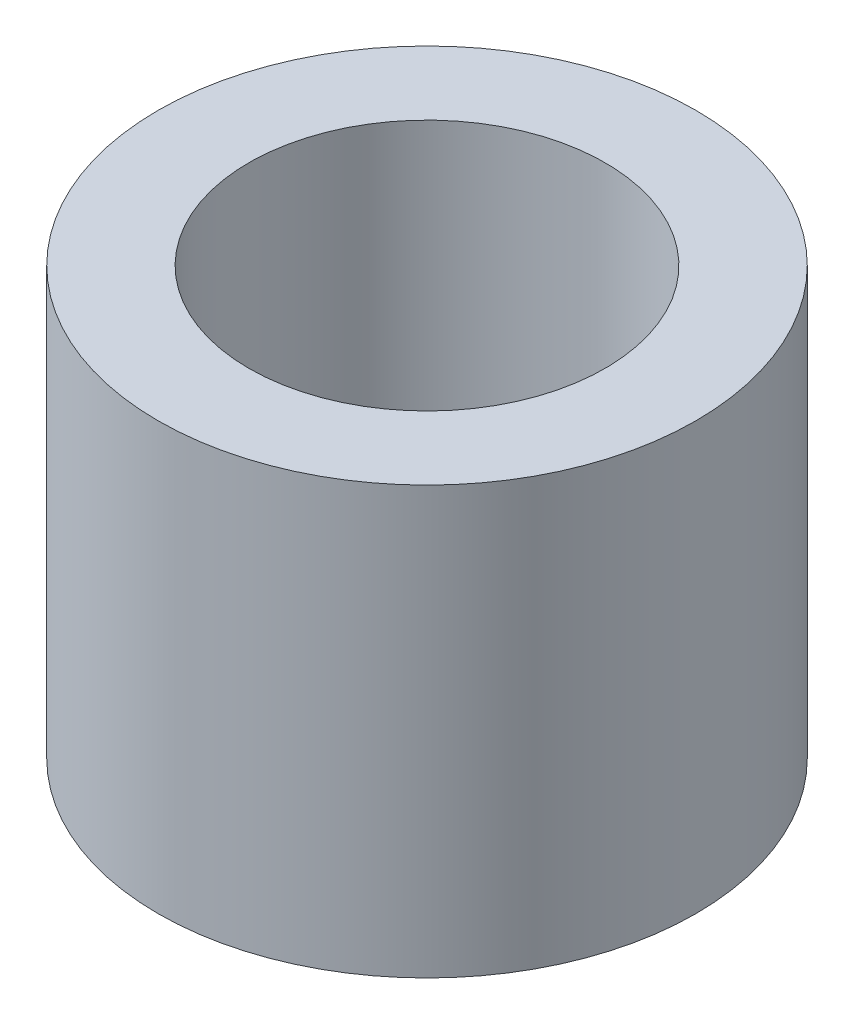
ISO-10303-21;
HEADER;
FILE_DESCRIPTION(('STEP AP214'),'2;1');
FILE_NAME('part.step','',(''),(''),'','','');
FILE_SCHEMA(('AUTOMOTIVE_DESIGN { 1 0 10303 214 1 1 1 1 }'));
ENDSEC;
DATA;
#1=APPLICATION_CONTEXT('core data for automotive mechanical design processes');
#2=APPLICATION_PROTOCOL_DEFINITION('international standard','automotive_design',2000,#1);
#3=PRODUCT_CONTEXT('',#1,'mechanical');
#4=PRODUCT('Part','Part','',(#3));
#5=PRODUCT_RELATED_PRODUCT_CATEGORY('part','',(#4));
#6=PRODUCT_DEFINITION_FORMATION('','',#4);
#7=PRODUCT_DEFINITION_CONTEXT('part definition',#1,'design');
#8=PRODUCT_DEFINITION('design','',#6,#7);
#9=PRODUCT_DEFINITION_SHAPE('','',#8);
#10=(LENGTH_UNIT() NAMED_UNIT(*) SI_UNIT(.MILLI.,.METRE.));
#11=(NAMED_UNIT(*) PLANE_ANGLE_UNIT() SI_UNIT($,.RADIAN.));
#12=(NAMED_UNIT(*) SI_UNIT($,.STERADIAN.) SOLID_ANGLE_UNIT());
#13=UNCERTAINTY_MEASURE_WITH_UNIT(LENGTH_MEASURE(1.E-05),#10,'distance_accuracy_value','');
#14=(GEOMETRIC_REPRESENTATION_CONTEXT(3) GLOBAL_UNCERTAINTY_ASSIGNED_CONTEXT((#13)) GLOBAL_UNIT_ASSIGNED_CONTEXT((#10,
#11,#12)) REPRESENTATION_CONTEXT('',''));
#15=CARTESIAN_POINT('',(0.,0.,0.));
#16=DIRECTION('',(0.,0.,1.));
#17=DIRECTION('',(1.,0.,0.));
#18=AXIS2_PLACEMENT_3D('',#15,#16,#17);
#19=CARTESIAN_POINT('',(0.,6.35,0.));
#20=DIRECTION('',(0.,1.,0.));
#21=DIRECTION('',(0.,0.,1.));
#22=AXIS2_PLACEMENT_3D('',#19,#20,#21);
#23=PLANE('',#22);
#24=CARTESIAN_POINT('',(0.,6.35,0.));
#25=DIRECTION('',(0.,1.,0.));
#26=DIRECTION('',(0.,0.,1.));
#27=AXIS2_PLACEMENT_3D('',#24,#25,#26);
#28=CIRCLE('',#27,4.);
#29=CARTESIAN_POINT('',(0.,6.35,4.));
#30=VERTEX_POINT('',#29);
#31=EDGE_CURVE('E10',#30,#30,#28,.T.);
#32=ORIENTED_EDGE('',*,*,#31,.T.);
#33=EDGE_LOOP('',(#32));
#34=FACE_BOUND('',#33,.T.);
#35=CARTESIAN_POINT('',(0.,6.35,0.));
#36=DIRECTION('',(0.,1.,0.));
#37=DIRECTION('',(0.,0.,1.));
#38=AXIS2_PLACEMENT_3D('',#35,#36,#37);
#39=CIRCLE('',#38,2.65);
#40=CARTESIAN_POINT('',(0.,6.35,2.65));
#41=VERTEX_POINT('',#40);
#42=EDGE_CURVE('E50',#41,#41,#39,.T.);
#43=ORIENTED_EDGE('',*,*,#42,.F.);
#44=EDGE_LOOP('',(#43));
#45=FACE_BOUND('',#44,.T.);
#46=ADVANCED_FACE('F37',(#34,#45),#23,.T.);
#47=CARTESIAN_POINT('',(0.,0.,0.));
#48=DIRECTION('',(0.,1.,0.));
#49=DIRECTION('',(0.,0.,1.));
#50=AXIS2_PLACEMENT_3D('',#47,#48,#49);
#51=PLANE('',#50);
#52=CARTESIAN_POINT('',(0.,0.,0.));
#53=DIRECTION('',(0.,1.,0.));
#54=DIRECTION('',(0.,0.,1.));
#55=AXIS2_PLACEMENT_3D('',#52,#53,#54);
#56=CIRCLE('',#55,4.);
#57=CARTESIAN_POINT('',(0.,0.,4.));
#58=VERTEX_POINT('',#57);
#59=EDGE_CURVE('E41',#58,#58,#56,.T.);
#60=ORIENTED_EDGE('',*,*,#59,.F.);
#61=EDGE_LOOP('',(#60));
#62=FACE_BOUND('',#61,.T.);
#63=CARTESIAN_POINT('',(0.,0.,0.));
#64=DIRECTION('',(0.,1.,0.));
#65=DIRECTION('',(0.,0.,1.));
#66=AXIS2_PLACEMENT_3D('',#63,#64,#65);
#67=CIRCLE('',#66,2.65);
#68=CARTESIAN_POINT('',(0.,0.,2.65));
#69=VERTEX_POINT('',#68);
#70=EDGE_CURVE('E52',#69,#69,#67,.T.);
#71=ORIENTED_EDGE('',*,*,#70,.T.);
#72=EDGE_LOOP('',(#71));
#73=FACE_BOUND('',#72,.T.);
#74=ADVANCED_FACE('F64',(#62,#73),#51,.F.);
#75=CARTESIAN_POINT('',(0.,6.35,0.));
#76=DIRECTION('',(0.,-1.,0.));
#77=DIRECTION('',(0.,0.,-1.));
#78=AXIS2_PLACEMENT_3D('',#75,#76,#77);
#79=CYLINDRICAL_SURFACE('',#78,4.);
#80=ORIENTED_EDGE('',*,*,#31,.F.);
#81=EDGE_LOOP('',(#80));
#82=FACE_BOUND('',#81,.T.);
#83=ORIENTED_EDGE('',*,*,#59,.T.);
#84=EDGE_LOOP('',(#83));
#85=FACE_BOUND('',#84,.T.);
#86=ADVANCED_FACE('F39',(#82,#85),#79,.T.);
#87=CARTESIAN_POINT('',(0.,6.35,0.));
#88=DIRECTION('',(0.,-1.,0.));
#89=DIRECTION('',(0.,0.,-1.));
#90=AXIS2_PLACEMENT_3D('',#87,#88,#89);
#91=CYLINDRICAL_SURFACE('',#90,2.65);
#92=ORIENTED_EDGE('',*,*,#42,.T.);
#93=EDGE_LOOP('',(#92));
#94=FACE_BOUND('',#93,.T.);
#95=ORIENTED_EDGE('',*,*,#70,.F.);
#96=EDGE_LOOP('',(#95));
#97=FACE_BOUND('',#96,.T.);
#98=ADVANCED_FACE('F60',(#94,#97),#91,.F.);
#99=CLOSED_SHELL('',(#46,#74,#86,#98));
#100=MANIFOLD_SOLID_BREP('B2',#99);
#101=ADVANCED_BREP_SHAPE_REPRESENTATION('',(#18,#100),#14);
#102=SHAPE_DEFINITION_REPRESENTATION(#9,#101);
ENDSEC;
END-ISO-10303-21;
